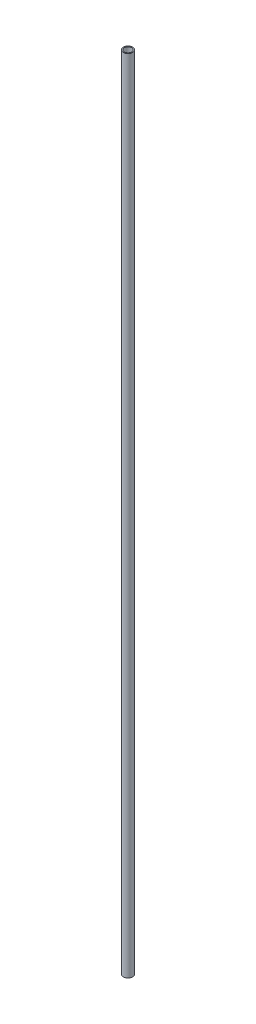
ISO-10303-21;
HEADER;
FILE_DESCRIPTION(('STEP AP214'),'2;1');
FILE_NAME('part.step','',(''),(''),'','','');
FILE_SCHEMA(('AUTOMOTIVE_DESIGN { 1 0 10303 214 1 1 1 1 }'));
ENDSEC;
DATA;
#1=APPLICATION_CONTEXT('core data for automotive mechanical design processes');
#2=APPLICATION_PROTOCOL_DEFINITION('international standard','automotive_design',2000,#1);
#3=PRODUCT_CONTEXT('',#1,'mechanical');
#4=PRODUCT('Part','Part','',(#3));
#5=PRODUCT_RELATED_PRODUCT_CATEGORY('part','',(#4));
#6=PRODUCT_DEFINITION_FORMATION('','',#4);
#7=PRODUCT_DEFINITION_CONTEXT('part definition',#1,'design');
#8=PRODUCT_DEFINITION('design','',#6,#7);
#9=PRODUCT_DEFINITION_SHAPE('','',#8);
#10=(LENGTH_UNIT() NAMED_UNIT(*) SI_UNIT(.MILLI.,.METRE.));
#11=(NAMED_UNIT(*) PLANE_ANGLE_UNIT() SI_UNIT($,.RADIAN.));
#12=(NAMED_UNIT(*) SI_UNIT($,.STERADIAN.) SOLID_ANGLE_UNIT());
#13=UNCERTAINTY_MEASURE_WITH_UNIT(LENGTH_MEASURE(1.E-05),#10,'distance_accuracy_value','');
#14=(GEOMETRIC_REPRESENTATION_CONTEXT(3) GLOBAL_UNCERTAINTY_ASSIGNED_CONTEXT((#13)) GLOBAL_UNIT_ASSIGNED_CONTEXT((#10,
#11,#12)) REPRESENTATION_CONTEXT('',''));
#15=CARTESIAN_POINT('',(0.,0.,0.));
#16=DIRECTION('',(0.,0.,1.));
#17=DIRECTION('',(1.,0.,0.));
#18=AXIS2_PLACEMENT_3D('',#15,#16,#17);
#19=CARTESIAN_POINT('',(0.,622.3,0.));
#20=DIRECTION('',(0.,1.,0.));
#21=DIRECTION('',(0.,0.,1.));
#22=AXIS2_PLACEMENT_3D('',#19,#20,#21);
#23=PLANE('',#22);
#24=CARTESIAN_POINT('',(0.,622.3,0.));
#25=DIRECTION('',(0.,1.,0.));
#26=DIRECTION('',(0.,0.,1.));
#27=AXIS2_PLACEMENT_3D('',#24,#25,#26);
#28=CIRCLE('',#27,3.6195);
#29=CARTESIAN_POINT('',(0.,622.3,3.6195));
#30=VERTEX_POINT('',#29);
#31=EDGE_CURVE('E10',#30,#30,#28,.T.);
#32=ORIENTED_EDGE('',*,*,#31,.T.);
#33=EDGE_LOOP('',(#32));
#34=FACE_BOUND('',#33,.T.);
#35=CARTESIAN_POINT('',(0.,622.3,0.));
#36=DIRECTION('',(0.,1.,0.));
#37=DIRECTION('',(0.,0.,1.));
#38=AXIS2_PLACEMENT_3D('',#35,#36,#37);
#39=CIRCLE('',#38,2.8575);
#40=CARTESIAN_POINT('',(0.,622.3,2.8575));
#41=VERTEX_POINT('',#40);
#42=EDGE_CURVE('E50',#41,#41,#39,.T.);
#43=ORIENTED_EDGE('',*,*,#42,.F.);
#44=EDGE_LOOP('',(#43));
#45=FACE_BOUND('',#44,.T.);
#46=ADVANCED_FACE('F37',(#34,#45),#23,.T.);
#47=CARTESIAN_POINT('',(0.,0.,0.));
#48=DIRECTION('',(0.,1.,0.));
#49=DIRECTION('',(0.,0.,1.));
#50=AXIS2_PLACEMENT_3D('',#47,#48,#49);
#51=PLANE('',#50);
#52=CARTESIAN_POINT('',(0.,0.,0.));
#53=DIRECTION('',(0.,1.,0.));
#54=DIRECTION('',(0.,0.,1.));
#55=AXIS2_PLACEMENT_3D('',#52,#53,#54);
#56=CIRCLE('',#55,3.6195);
#57=CARTESIAN_POINT('',(0.,0.,3.6195));
#58=VERTEX_POINT('',#57);
#59=EDGE_CURVE('E41',#58,#58,#56,.T.);
#60=ORIENTED_EDGE('',*,*,#59,.F.);
#61=EDGE_LOOP('',(#60));
#62=FACE_BOUND('',#61,.T.);
#63=CARTESIAN_POINT('',(0.,0.,0.));
#64=DIRECTION('',(0.,1.,0.));
#65=DIRECTION('',(0.,0.,1.));
#66=AXIS2_PLACEMENT_3D('',#63,#64,#65);
#67=CIRCLE('',#66,2.8575);
#68=CARTESIAN_POINT('',(0.,0.,2.8575));
#69=VERTEX_POINT('',#68);
#70=EDGE_CURVE('E52',#69,#69,#67,.T.);
#71=ORIENTED_EDGE('',*,*,#70,.T.);
#72=EDGE_LOOP('',(#71));
#73=FACE_BOUND('',#72,.T.);
#74=ADVANCED_FACE('F64',(#62,#73),#51,.F.);
#75=CARTESIAN_POINT('',(0.,622.3,0.));
#76=DIRECTION('',(0.,-1.,0.));
#77=DIRECTION('',(0.,0.,-1.));
#78=AXIS2_PLACEMENT_3D('',#75,#76,#77);
#79=CYLINDRICAL_SURFACE('',#78,3.6195);
#80=ORIENTED_EDGE('',*,*,#31,.F.);
#81=EDGE_LOOP('',(#80));
#82=FACE_BOUND('',#81,.T.);
#83=ORIENTED_EDGE('',*,*,#59,.T.);
#84=EDGE_LOOP('',(#83));
#85=FACE_BOUND('',#84,.T.);
#86=ADVANCED_FACE('F39',(#82,#85),#79,.T.);
#87=CARTESIAN_POINT('',(0.,622.3,0.));
#88=DIRECTION('',(0.,-1.,0.));
#89=DIRECTION('',(0.,0.,-1.));
#90=AXIS2_PLACEMENT_3D('',#87,#88,#89);
#91=CYLINDRICAL_SURFACE('',#90,2.8575);
#92=ORIENTED_EDGE('',*,*,#42,.T.);
#93=EDGE_LOOP('',(#92));
#94=FACE_BOUND('',#93,.T.);
#95=ORIENTED_EDGE('',*,*,#70,.F.);
#96=EDGE_LOOP('',(#95));
#97=FACE_BOUND('',#96,.T.);
#98=ADVANCED_FACE('F60',(#94,#97),#91,.F.);
#99=CLOSED_SHELL('',(#46,#74,#86,#98));
#100=MANIFOLD_SOLID_BREP('B2',#99);
#101=ADVANCED_BREP_SHAPE_REPRESENTATION('',(#18,#100),#14);
#102=SHAPE_DEFINITION_REPRESENTATION(#9,#101);
ENDSEC;
END-ISO-10303-21;
